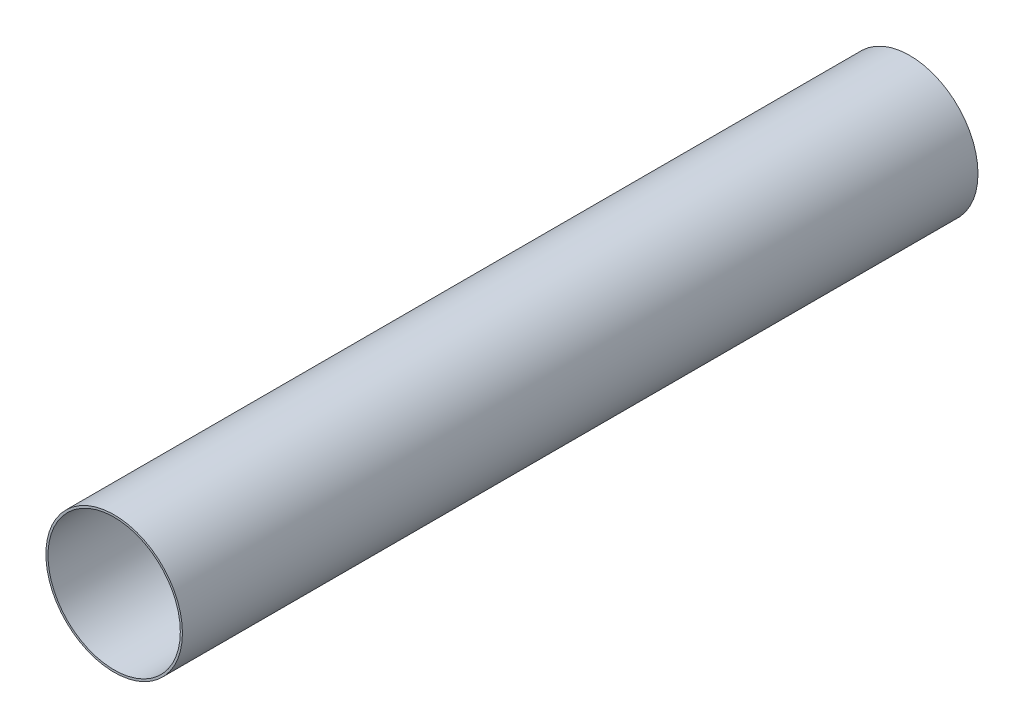
ISO-10303-21;
HEADER;
FILE_DESCRIPTION(('STEP AP214'),'2;1');
FILE_NAME('part.step','',(''),(''),'','','');
FILE_SCHEMA(('AUTOMOTIVE_DESIGN { 1 0 10303 214 1 1 1 1 }'));
ENDSEC;
DATA;
#1=APPLICATION_CONTEXT('core data for automotive mechanical design processes');
#2=APPLICATION_PROTOCOL_DEFINITION('international standard','automotive_design',2000,#1);
#3=PRODUCT_CONTEXT('',#1,'mechanical');
#4=PRODUCT('Part','Part','',(#3));
#5=PRODUCT_RELATED_PRODUCT_CATEGORY('part','',(#4));
#6=PRODUCT_DEFINITION_FORMATION('','',#4);
#7=PRODUCT_DEFINITION_CONTEXT('part definition',#1,'design');
#8=PRODUCT_DEFINITION('design','',#6,#7);
#9=PRODUCT_DEFINITION_SHAPE('','',#8);
#10=(LENGTH_UNIT() NAMED_UNIT(*) SI_UNIT(.MILLI.,.METRE.));
#11=(NAMED_UNIT(*) PLANE_ANGLE_UNIT() SI_UNIT($,.RADIAN.));
#12=(NAMED_UNIT(*) SI_UNIT($,.STERADIAN.) SOLID_ANGLE_UNIT());
#13=UNCERTAINTY_MEASURE_WITH_UNIT(LENGTH_MEASURE(1.E-05),#10,'distance_accuracy_value','');
#14=(GEOMETRIC_REPRESENTATION_CONTEXT(3) GLOBAL_UNCERTAINTY_ASSIGNED_CONTEXT((#13)) GLOBAL_UNIT_ASSIGNED_CONTEXT((#10,
#11,#12)) REPRESENTATION_CONTEXT('',''));
#15=CARTESIAN_POINT('',(0.,0.,0.));
#16=DIRECTION('',(0.,0.,1.));
#17=DIRECTION('',(1.,0.,0.));
#18=AXIS2_PLACEMENT_3D('',#15,#16,#17);
#19=CARTESIAN_POINT('',(0.,0.,381.));
#20=DIRECTION('',(0.,0.,1.));
#21=DIRECTION('',(1.,0.,0.));
#22=AXIS2_PLACEMENT_3D('',#19,#20,#21);
#23=PLANE('',#22);
#24=CARTESIAN_POINT('',(0.,0.,381.));
#25=DIRECTION('',(0.,0.,1.));
#26=DIRECTION('',(1.,0.,0.));
#27=AXIS2_PLACEMENT_3D('',#24,#25,#26);
#28=CIRCLE('',#27,65.405);
#29=CARTESIAN_POINT('',(65.405,0.,381.));
#30=VERTEX_POINT('',#29);
#31=EDGE_CURVE('E10',#30,#30,#28,.T.);
#32=ORIENTED_EDGE('',*,*,#31,.T.);
#33=EDGE_LOOP('',(#32));
#34=FACE_BOUND('',#33,.T.);
#35=CARTESIAN_POINT('',(0.,0.,381.));
#36=DIRECTION('',(0.,0.,1.));
#37=DIRECTION('',(1.,0.,0.));
#38=AXIS2_PLACEMENT_3D('',#35,#36,#37);
#39=CIRCLE('',#38,63.373);
#40=CARTESIAN_POINT('',(63.373,0.,381.));
#41=VERTEX_POINT('',#40);
#42=EDGE_CURVE('E60',#41,#41,#39,.T.);
#43=ORIENTED_EDGE('',*,*,#42,.F.);
#44=EDGE_LOOP('',(#43));
#45=FACE_BOUND('',#44,.T.);
#46=ADVANCED_FACE('F49',(#34,#45),#23,.T.);
#47=CARTESIAN_POINT('',(0.,0.,-381.));
#48=DIRECTION('',(0.,0.,1.));
#49=DIRECTION('',(1.,0.,0.));
#50=AXIS2_PLACEMENT_3D('',#47,#48,#49);
#51=PLANE('',#50);
#52=CARTESIAN_POINT('',(0.,0.,-381.));
#53=DIRECTION('',(0.,0.,1.));
#54=DIRECTION('',(1.,0.,0.));
#55=AXIS2_PLACEMENT_3D('',#52,#53,#54);
#56=CIRCLE('',#55,65.405);
#57=CARTESIAN_POINT('',(65.405,0.,-381.));
#58=VERTEX_POINT('',#57);
#59=EDGE_CURVE('E53',#58,#58,#56,.T.);
#60=ORIENTED_EDGE('',*,*,#59,.F.);
#61=EDGE_LOOP('',(#60));
#62=FACE_BOUND('',#61,.T.);
#63=CARTESIAN_POINT('',(0.,0.,-381.));
#64=DIRECTION('',(0.,0.,1.));
#65=DIRECTION('',(1.,0.,0.));
#66=AXIS2_PLACEMENT_3D('',#63,#64,#65);
#67=CIRCLE('',#66,63.373);
#68=CARTESIAN_POINT('',(63.373,0.,-381.));
#69=VERTEX_POINT('',#68);
#70=EDGE_CURVE('E62',#69,#69,#67,.T.);
#71=ORIENTED_EDGE('',*,*,#70,.T.);
#72=EDGE_LOOP('',(#71));
#73=FACE_BOUND('',#72,.T.);
#74=ADVANCED_FACE('F72',(#62,#73),#51,.F.);
#75=CARTESIAN_POINT('',(0.,0.,381.));
#76=DIRECTION('',(0.,0.,-1.));
#77=DIRECTION('',(-1.,0.,0.));
#78=AXIS2_PLACEMENT_3D('',#75,#76,#77);
#79=CYLINDRICAL_SURFACE('',#78,65.405);
#80=ORIENTED_EDGE('',*,*,#31,.F.);
#81=EDGE_LOOP('',(#80));
#82=FACE_BOUND('',#81,.T.);
#83=ORIENTED_EDGE('',*,*,#59,.T.);
#84=EDGE_LOOP('',(#83));
#85=FACE_BOUND('',#84,.T.);
#86=ADVANCED_FACE('F51',(#82,#85),#79,.T.);
#87=CARTESIAN_POINT('',(0.,0.,381.));
#88=DIRECTION('',(0.,0.,-1.));
#89=DIRECTION('',(-1.,0.,0.));
#90=AXIS2_PLACEMENT_3D('',#87,#88,#89);
#91=CYLINDRICAL_SURFACE('',#90,63.373);
#92=ORIENTED_EDGE('',*,*,#42,.T.);
#93=EDGE_LOOP('',(#92));
#94=FACE_BOUND('',#93,.T.);
#95=ORIENTED_EDGE('',*,*,#70,.F.);
#96=EDGE_LOOP('',(#95));
#97=FACE_BOUND('',#96,.T.);
#98=ADVANCED_FACE('F68',(#94,#97),#91,.F.);
#99=CLOSED_SHELL('',(#46,#74,#86,#98));
#100=MANIFOLD_SOLID_BREP('B2',#99);
#101=ADVANCED_BREP_SHAPE_REPRESENTATION('',(#18,#100),#14);
#102=SHAPE_DEFINITION_REPRESENTATION(#9,#101);
ENDSEC;
END-ISO-10303-21;
